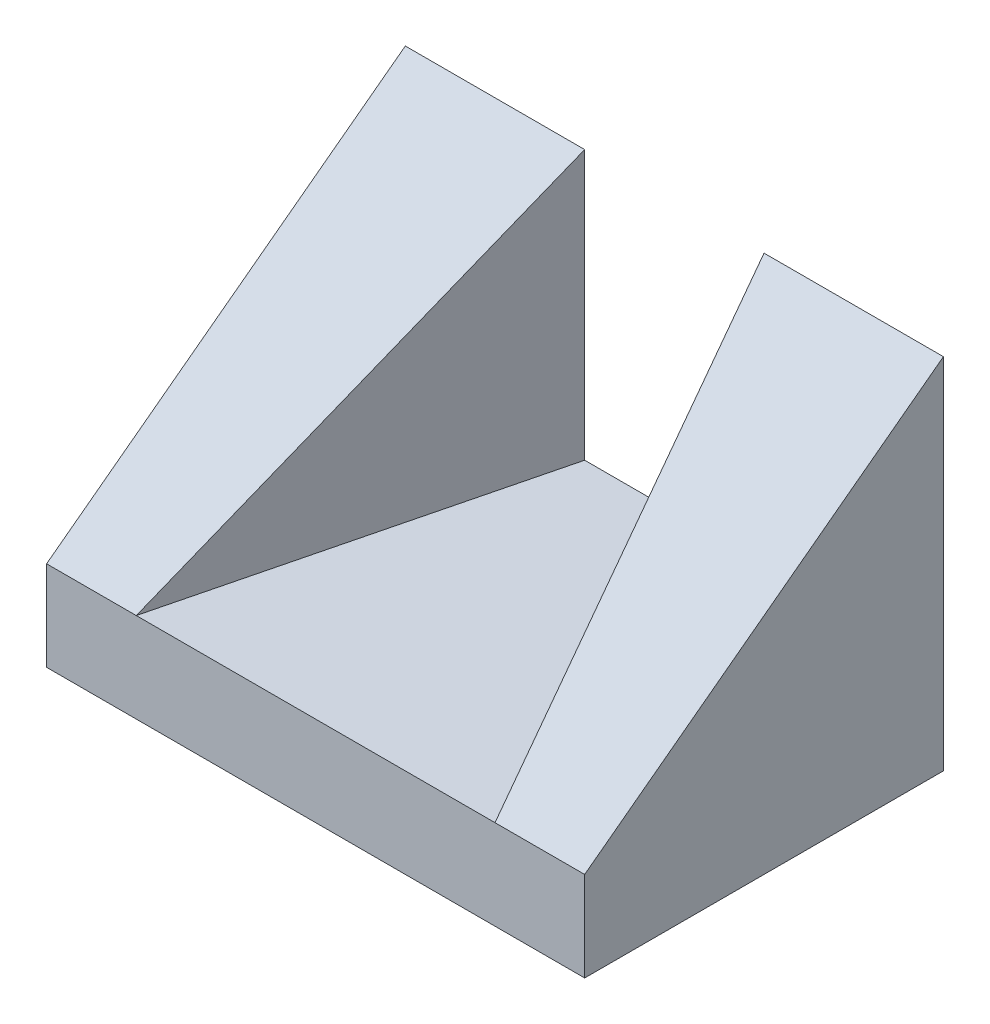
ISO-10303-21;
HEADER;
FILE_DESCRIPTION(('STEP AP214'),'2;1');
FILE_NAME('part.step','',(''),(''),'','','');
FILE_SCHEMA(('AUTOMOTIVE_DESIGN { 1 0 10303 214 1 1 1 1 }'));
ENDSEC;
DATA;
#1=APPLICATION_CONTEXT('core data for automotive mechanical design processes');
#2=APPLICATION_PROTOCOL_DEFINITION('international standard','automotive_design',2000,#1);
#3=PRODUCT_CONTEXT('',#1,'mechanical');
#4=PRODUCT('Part','Part','',(#3));
#5=PRODUCT_RELATED_PRODUCT_CATEGORY('part','',(#4));
#6=PRODUCT_DEFINITION_FORMATION('','',#4);
#7=PRODUCT_DEFINITION_CONTEXT('part definition',#1,'design');
#8=PRODUCT_DEFINITION('design','',#6,#7);
#9=PRODUCT_DEFINITION_SHAPE('','',#8);
#10=(LENGTH_UNIT() NAMED_UNIT(*) SI_UNIT(.MILLI.,.METRE.));
#11=(NAMED_UNIT(*) PLANE_ANGLE_UNIT() SI_UNIT($,.RADIAN.));
#12=(NAMED_UNIT(*) SI_UNIT($,.STERADIAN.) SOLID_ANGLE_UNIT());
#13=UNCERTAINTY_MEASURE_WITH_UNIT(LENGTH_MEASURE(1.E-05),#10,'distance_accuracy_value','');
#14=(GEOMETRIC_REPRESENTATION_CONTEXT(3) GLOBAL_UNCERTAINTY_ASSIGNED_CONTEXT((#13)) GLOBAL_UNIT_ASSIGNED_CONTEXT((#10,
#11,#12)) REPRESENTATION_CONTEXT('',''));
#15=CARTESIAN_POINT('',(0.,0.,0.));
#16=DIRECTION('',(0.,0.,1.));
#17=DIRECTION('',(1.,0.,0.));
#18=AXIS2_PLACEMENT_3D('',#15,#16,#17);
#19=CARTESIAN_POINT('',(-4.736951571734E-12,10000.,-40000.));
#20=DIRECTION('',(0.,0.,-1.));
#21=DIRECTION('',(-1.,0.,0.));
#22=AXIS2_PLACEMENT_3D('',#19,#20,#21);
#23=PLANE('',#22);
#24=DIRECTION('',(1.,0.,0.));
#25=VECTOR('',#24,1.);
#26=CARTESIAN_POINT('',(-4.736951571734E-12,0.,-40000.));
#27=LINE('',#26,#25);
#28=CARTESIAN_POINT('',(0.,0.,-40000.));
#29=VERTEX_POINT('',#28);
#30=CARTESIAN_POINT('',(60000.,0.,-40000.));
#31=VERTEX_POINT('',#30);
#32=EDGE_CURVE('E94',#29,#31,#27,.T.);
#33=ORIENTED_EDGE('',*,*,#32,.F.);
#34=DIRECTION('',(0.,-1.,0.));
#35=VECTOR('',#34,1.);
#36=CARTESIAN_POINT('',(0.,40000.,-40000.));
#37=LINE('',#36,#35);
#38=CARTESIAN_POINT('',(5.6843418860808E-11,40000.,-40000.));
#39=VERTEX_POINT('',#38);
#40=EDGE_CURVE('E150',#39,#29,#37,.T.);
#41=ORIENTED_EDGE('',*,*,#40,.F.);
#42=DIRECTION('',(1.,0.,0.));
#43=VECTOR('',#42,1.);
#44=CARTESIAN_POINT('',(-4.736951571734E-12,40000.,-40000.));
#45=LINE('',#44,#43);
#46=CARTESIAN_POINT('',(20000.,40000.,-40000.));
#47=VERTEX_POINT('',#46);
#48=EDGE_CURVE('E99',#39,#47,#45,.T.);
#49=ORIENTED_EDGE('',*,*,#48,.T.);
#50=DIRECTION('',(0.,-1.,0.));
#51=VECTOR('',#50,1.);
#52=CARTESIAN_POINT('',(20000.,40000.,-40000.));
#53=LINE('',#52,#51);
#54=CARTESIAN_POINT('',(20000.,10000.,-40000.));
#55=VERTEX_POINT('',#54);
#56=EDGE_CURVE('E157',#47,#55,#53,.T.);
#57=ORIENTED_EDGE('',*,*,#56,.T.);
#58=DIRECTION('',(1.,0.,0.));
#59=VECTOR('',#58,1.);
#60=CARTESIAN_POINT('',(-4.736951571734E-12,10000.,-40000.));
#61=LINE('',#60,#59);
#62=CARTESIAN_POINT('',(40000.,10000.,-40000.));
#63=VERTEX_POINT('',#62);
#64=EDGE_CURVE('E49',#55,#63,#61,.T.);
#65=ORIENTED_EDGE('',*,*,#64,.T.);
#66=DIRECTION('',(0.,-1.,0.));
#67=VECTOR('',#66,1.);
#68=CARTESIAN_POINT('',(40000.,40000.,-40000.));
#69=LINE('',#68,#67);
#70=CARTESIAN_POINT('',(40000.0000000001,40000.,-40000.));
#71=VERTEX_POINT('',#70);
#72=EDGE_CURVE('E130',#71,#63,#69,.T.);
#73=ORIENTED_EDGE('',*,*,#72,.F.);
#74=DIRECTION('',(1.,0.,0.));
#75=VECTOR('',#74,1.);
#76=CARTESIAN_POINT('',(-4.736951571734E-12,40000.,-40000.));
#77=LINE('',#76,#75);
#78=CARTESIAN_POINT('',(60000.,40000.,-40000.));
#79=VERTEX_POINT('',#78);
#80=EDGE_CURVE('E104',#71,#79,#77,.T.);
#81=ORIENTED_EDGE('',*,*,#80,.T.);
#82=DIRECTION('',(0.,-1.,0.));
#83=VECTOR('',#82,1.);
#84=CARTESIAN_POINT('',(60000.,40000.,-40000.));
#85=LINE('',#84,#83);
#86=EDGE_CURVE('E124',#79,#31,#85,.T.);
#87=ORIENTED_EDGE('',*,*,#86,.T.);
#88=EDGE_LOOP('',(#33,#41,#49,#57,#65,#73,#81,#87));
#89=FACE_BOUND('',#88,.T.);
#90=ADVANCED_FACE('F33',(#89),#23,.T.);
#91=CARTESIAN_POINT('',(0.,10000.,0.));
#92=DIRECTION('',(0.,0.,1.));
#93=DIRECTION('',(1.,0.,0.));
#94=AXIS2_PLACEMENT_3D('',#91,#92,#93);
#95=PLANE('',#94);
#96=DIRECTION('',(-1.,0.,0.));
#97=VECTOR('',#96,1.);
#98=CARTESIAN_POINT('',(238077.640640442,10000.,-3.16329434895908E-11));
#99=LINE('',#98,#97);
#100=CARTESIAN_POINT('',(10000.,10000.,1.24344978758018E-11));
#101=VERTEX_POINT('',#100);
#102=CARTESIAN_POINT('',(5.6843418860808E-11,10000.,1.06581410364015E-11));
#103=VERTEX_POINT('',#102);
#104=EDGE_CURVE('E121',#101,#103,#99,.T.);
#105=ORIENTED_EDGE('',*,*,#104,.T.);
#106=DIRECTION('',(0.,-1.,0.));
#107=VECTOR('',#106,1.);
#108=CARTESIAN_POINT('',(0.,40000.,0.));
#109=LINE('',#108,#107);
#110=CARTESIAN_POINT('',(0.,0.,0.));
#111=VERTEX_POINT('',#110);
#112=EDGE_CURVE('E149',#103,#111,#109,.T.);
#113=ORIENTED_EDGE('',*,*,#112,.T.);
#114=DIRECTION('',(-1.,0.,0.));
#115=VECTOR('',#114,1.);
#116=CARTESIAN_POINT('',(0.,0.,0.));
#117=LINE('',#116,#115);
#118=CARTESIAN_POINT('',(60000.,0.,-7.34788079787365E-12));
#119=VERTEX_POINT('',#118);
#120=EDGE_CURVE('E36',#119,#111,#117,.T.);
#121=ORIENTED_EDGE('',*,*,#120,.F.);
#122=DIRECTION('',(0.,-1.,0.));
#123=VECTOR('',#122,1.);
#124=CARTESIAN_POINT('',(60000.,40000.,-7.34788079787365E-12));
#125=LINE('',#124,#123);
#126=CARTESIAN_POINT('',(60000.0000000001,10000.,0.));
#127=VERTEX_POINT('',#126);
#128=EDGE_CURVE('E70',#127,#119,#125,.T.);
#129=ORIENTED_EDGE('',*,*,#128,.F.);
#130=CARTESIAN_POINT('',(50000.,10000.,6.21724893790088E-12));
#131=VERTEX_POINT('',#130);
#132=EDGE_CURVE('E114',#127,#131,#99,.T.);
#133=ORIENTED_EDGE('',*,*,#132,.T.);
#134=DIRECTION('',(-1.,0.,0.));
#135=VECTOR('',#134,1.);
#136=CARTESIAN_POINT('',(0.,10000.,0.));
#137=LINE('',#136,#135);
#138=EDGE_CURVE('E41',#131,#101,#137,.T.);
#139=ORIENTED_EDGE('',*,*,#138,.T.);
#140=EDGE_LOOP('',(#105,#113,#121,#129,#133,#139));
#141=FACE_BOUND('',#140,.T.);
#142=ADVANCED_FACE('F127',(#141),#95,.T.);
#143=CARTESIAN_POINT('',(0.,10000.,0.));
#144=DIRECTION('',(0.,1.,0.));
#145=DIRECTION('',(0.,0.,1.));
#146=AXIS2_PLACEMENT_3D('',#143,#144,#145);
#147=PLANE('',#146);
#148=ORIENTED_EDGE('',*,*,#64,.F.);
#149=DIRECTION('',(0.242535625036333,0.,-0.970142500145332));
#150=VECTOR('',#149,1.);
#151=CARTESIAN_POINT('',(9411.76470588235,10000.,2352.94117647059));
#152=LINE('',#151,#150);
#153=EDGE_CURVE('E138',#101,#55,#152,.T.);
#154=ORIENTED_EDGE('',*,*,#153,.F.);
#155=ORIENTED_EDGE('',*,*,#138,.F.);
#156=DIRECTION('',(0.242535625036333,0.,0.970142500145332));
#157=VECTOR('',#156,1.);
#158=CARTESIAN_POINT('',(47058.8235294118,10000.,-11764.7058823529));
#159=LINE('',#158,#157);
#160=EDGE_CURVE('E11',#63,#131,#159,.T.);
#161=ORIENTED_EDGE('',*,*,#160,.F.);
#162=EDGE_LOOP('',(#148,#154,#155,#161));
#163=FACE_BOUND('',#162,.T.);
#164=ADVANCED_FACE('F161',(#163),#147,.T.);
#165=CARTESIAN_POINT('',(0.,0.,0.));
#166=DIRECTION('',(0.,1.,0.));
#167=DIRECTION('',(0.,0.,1.));
#168=AXIS2_PLACEMENT_3D('',#165,#166,#167);
#169=PLANE('',#168);
#170=ORIENTED_EDGE('',*,*,#32,.T.);
#171=DIRECTION('',(0.,0.,1.));
#172=VECTOR('',#171,1.);
#173=CARTESIAN_POINT('',(60000.,0.,-1.06581410364015E-11));
#174=LINE('',#173,#172);
#175=EDGE_CURVE('E145',#31,#119,#174,.T.);
#176=ORIENTED_EDGE('',*,*,#175,.T.);
#177=ORIENTED_EDGE('',*,*,#120,.T.);
#178=DIRECTION('',(0.,0.,-1.));
#179=VECTOR('',#178,1.);
#180=CARTESIAN_POINT('',(0.,0.,0.));
#181=LINE('',#180,#179);
#182=EDGE_CURVE('E144',#111,#29,#181,.T.);
#183=ORIENTED_EDGE('',*,*,#182,.T.);
#184=EDGE_LOOP('',(#170,#176,#177,#183));
#185=FACE_BOUND('',#184,.T.);
#186=ADVANCED_FACE('F143',(#185),#169,.F.);
#187=CARTESIAN_POINT('',(47058.8235294118,40000.,-11764.7058823529));
#188=DIRECTION('',(0.970142500145332,0.,-0.242535625036333));
#189=DIRECTION('',(-0.242535625036333,0.,-0.970142500145332));
#190=AXIS2_PLACEMENT_3D('',#187,#188,#189);
#191=PLANE('',#190);
#192=ORIENTED_EDGE('',*,*,#160,.T.);
#193=DIRECTION('',(-0.196116135138184,0.588348405414552,-0.784464540552736));
#194=VECTOR('',#193,1.);
#195=CARTESIAN_POINT('',(44615.3846153846,26153.8461538462,-21538.4615384615));
#196=LINE('',#195,#194);
#197=EDGE_CURVE('E116',#131,#71,#196,.T.);
#198=ORIENTED_EDGE('',*,*,#197,.T.);
#199=ORIENTED_EDGE('',*,*,#72,.T.);
#200=EDGE_LOOP('',(#192,#198,#199));
#201=FACE_BOUND('',#200,.T.);
#202=ADVANCED_FACE('F160',(#201),#191,.F.);
#203=CARTESIAN_POINT('',(60000.,40000.,-1.06581410364015E-11));
#204=DIRECTION('',(1.,0.,0.));
#205=DIRECTION('',(0.,0.,-1.));
#206=AXIS2_PLACEMENT_3D('',#203,#204,#205);
#207=PLANE('',#206);
#208=DIRECTION('',(0.,0.6,-0.8));
#209=VECTOR('',#208,1.);
#210=CARTESIAN_POINT('',(60000.,20800.,-14400.));
#211=LINE('',#210,#209);
#212=EDGE_CURVE('E58',#127,#79,#211,.T.);
#213=ORIENTED_EDGE('',*,*,#212,.F.);
#214=ORIENTED_EDGE('',*,*,#128,.T.);
#215=ORIENTED_EDGE('',*,*,#175,.F.);
#216=ORIENTED_EDGE('',*,*,#86,.F.);
#217=EDGE_LOOP('',(#213,#214,#215,#216));
#218=FACE_BOUND('',#217,.T.);
#219=ADVANCED_FACE('F123',(#218),#207,.T.);
#220=CARTESIAN_POINT('',(9411.76470588235,40000.,2352.94117647059));
#221=DIRECTION('',(-0.970142500145332,0.,-0.242535625036333));
#222=DIRECTION('',(-0.242535625036333,0.,0.970142500145332));
#223=AXIS2_PLACEMENT_3D('',#220,#221,#222);
#224=PLANE('',#223);
#225=ORIENTED_EDGE('',*,*,#56,.F.);
#226=DIRECTION('',(-0.196116135138184,-0.588348405414552,0.784464540552736));
#227=VECTOR('',#226,1.);
#228=CARTESIAN_POINT('',(13076.9230769231,19230.7692307692,-12307.6923076923));
#229=LINE('',#228,#227);
#230=EDGE_CURVE('E83',#47,#101,#229,.T.);
#231=ORIENTED_EDGE('',*,*,#230,.T.);
#232=ORIENTED_EDGE('',*,*,#153,.T.);
#233=EDGE_LOOP('',(#225,#231,#232));
#234=FACE_BOUND('',#233,.T.);
#235=ADVANCED_FACE('F165',(#234),#224,.F.);
#236=CARTESIAN_POINT('',(0.,40000.,0.));
#237=DIRECTION('',(-1.,0.,0.));
#238=DIRECTION('',(0.,0.,1.));
#239=AXIS2_PLACEMENT_3D('',#236,#237,#238);
#240=PLANE('',#239);
#241=DIRECTION('',(0.,-0.6,0.8));
#242=VECTOR('',#241,1.);
#243=CARTESIAN_POINT('',(0.,20800.,-14400.));
#244=LINE('',#243,#242);
#245=EDGE_CURVE('E120',#39,#103,#244,.T.);
#246=ORIENTED_EDGE('',*,*,#245,.F.);
#247=ORIENTED_EDGE('',*,*,#40,.T.);
#248=ORIENTED_EDGE('',*,*,#182,.F.);
#249=ORIENTED_EDGE('',*,*,#112,.F.);
#250=EDGE_LOOP('',(#246,#247,#248,#249));
#251=FACE_BOUND('',#250,.T.);
#252=ADVANCED_FACE('F148',(#251),#240,.T.);
#253=CARTESIAN_POINT('',(238077.640640442,40000.,-40000.));
#254=DIRECTION('',(0.,-0.8,-0.6));
#255=DIRECTION('',(0.,0.6,-0.8));
#256=AXIS2_PLACEMENT_3D('',#253,#254,#255);
#257=PLANE('',#256);
#258=ORIENTED_EDGE('',*,*,#230,.F.);
#259=ORIENTED_EDGE('',*,*,#48,.F.);
#260=ORIENTED_EDGE('',*,*,#245,.T.);
#261=ORIENTED_EDGE('',*,*,#104,.F.);
#262=EDGE_LOOP('',(#258,#259,#260,#261));
#263=FACE_BOUND('',#262,.T.);
#264=ADVANCED_FACE('F172',(#263),#257,.F.);
#265=ORIENTED_EDGE('',*,*,#197,.F.);
#266=ORIENTED_EDGE('',*,*,#132,.F.);
#267=ORIENTED_EDGE('',*,*,#212,.T.);
#268=ORIENTED_EDGE('',*,*,#80,.F.);
#269=EDGE_LOOP('',(#265,#266,#267,#268));
#270=FACE_BOUND('',#269,.T.);
#271=ADVANCED_FACE('F115',(#270),#257,.F.);
#272=CLOSED_SHELL('',(#90,#142,#164,#186,#202,#219,#235,#252,#264,#271));
#273=MANIFOLD_SOLID_BREP('B2',#272);
#274=ADVANCED_BREP_SHAPE_REPRESENTATION('',(#18,#273),#14);
#275=SHAPE_DEFINITION_REPRESENTATION(#9,#274);
ENDSEC;
END-ISO-10303-21;
